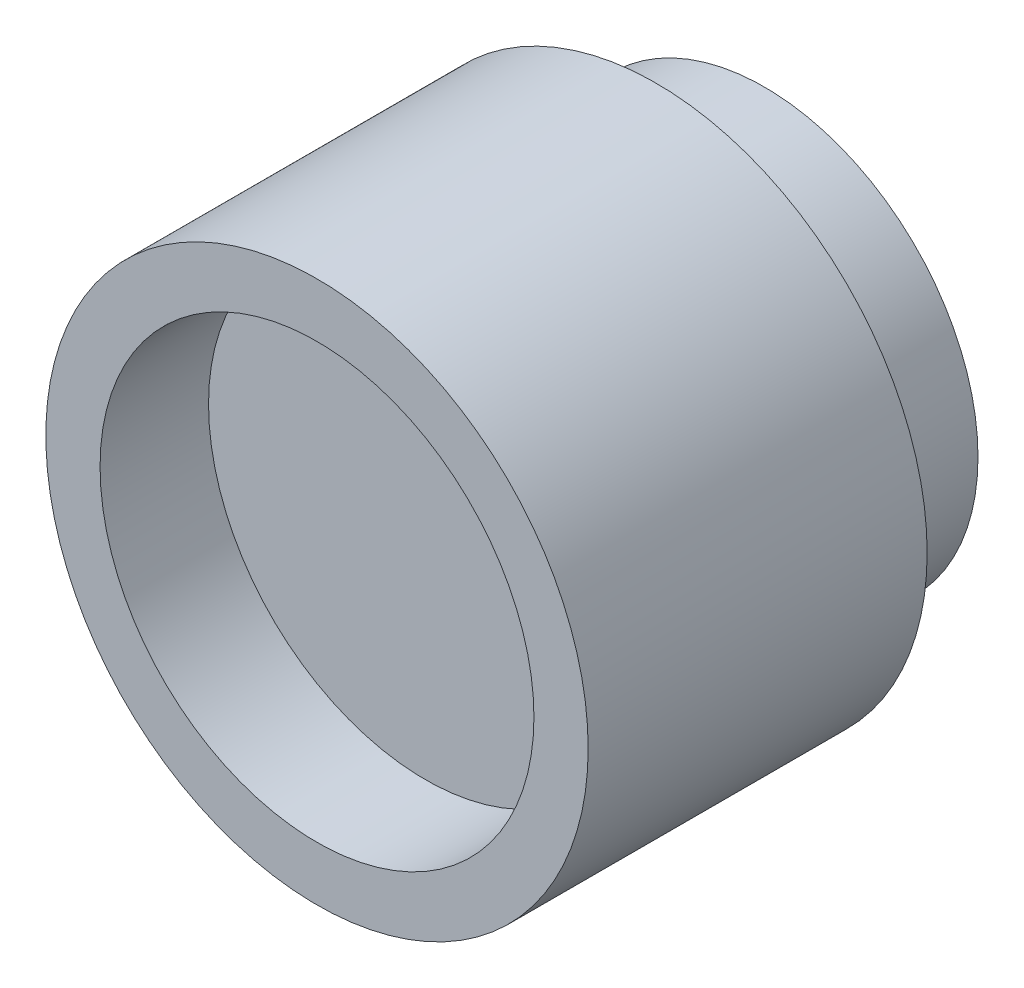
ISO-10303-21;
HEADER;
FILE_DESCRIPTION(('STEP AP214'),'2;1');
FILE_NAME('part.step','',(''),(''),'','','');
FILE_SCHEMA(('AUTOMOTIVE_DESIGN { 1 0 10303 214 1 1 1 1 }'));
ENDSEC;
DATA;
#1=APPLICATION_CONTEXT('core data for automotive mechanical design processes');
#2=APPLICATION_PROTOCOL_DEFINITION('international standard','automotive_design',2000,#1);
#3=PRODUCT_CONTEXT('',#1,'mechanical');
#4=PRODUCT('Part','Part','',(#3));
#5=PRODUCT_RELATED_PRODUCT_CATEGORY('part','',(#4));
#6=PRODUCT_DEFINITION_FORMATION('','',#4);
#7=PRODUCT_DEFINITION_CONTEXT('part definition',#1,'design');
#8=PRODUCT_DEFINITION('design','',#6,#7);
#9=PRODUCT_DEFINITION_SHAPE('','',#8);
#10=(LENGTH_UNIT() NAMED_UNIT(*) SI_UNIT(.MILLI.,.METRE.));
#11=(NAMED_UNIT(*) PLANE_ANGLE_UNIT() SI_UNIT($,.RADIAN.));
#12=(NAMED_UNIT(*) SI_UNIT($,.STERADIAN.) SOLID_ANGLE_UNIT());
#13=UNCERTAINTY_MEASURE_WITH_UNIT(LENGTH_MEASURE(1.E-05),#10,'distance_accuracy_value','');
#14=(GEOMETRIC_REPRESENTATION_CONTEXT(3) GLOBAL_UNCERTAINTY_ASSIGNED_CONTEXT((#13)) GLOBAL_UNIT_ASSIGNED_CONTEXT((#10,
#11,#12)) REPRESENTATION_CONTEXT('',''));
#15=CARTESIAN_POINT('',(0.,0.,0.));
#16=DIRECTION('',(0.,0.,1.));
#17=DIRECTION('',(1.,0.,0.));
#18=AXIS2_PLACEMENT_3D('',#15,#16,#17);
#19=CARTESIAN_POINT('',(0.,0.,33.));
#20=DIRECTION('',(0.,0.,-1.));
#21=DIRECTION('',(-1.,0.,0.));
#22=AXIS2_PLACEMENT_3D('',#19,#20,#21);
#23=CYLINDRICAL_SURFACE('',#22,15.75);
#24=CARTESIAN_POINT('',(0.,0.,0.));
#25=DIRECTION('',(0.,0.,1.));
#26=DIRECTION('',(1.,0.,0.));
#27=AXIS2_PLACEMENT_3D('',#24,#25,#26);
#28=CIRCLE('',#27,15.75);
#29=CARTESIAN_POINT('',(15.75,0.,0.));
#30=VERTEX_POINT('',#29);
#31=EDGE_CURVE('E42',#30,#30,#28,.T.);
#32=ORIENTED_EDGE('',*,*,#31,.T.);
#33=EDGE_LOOP('',(#32));
#34=FACE_BOUND('',#33,.T.);
#35=CARTESIAN_POINT('',(0.,0.,8.));
#36=DIRECTION('',(0.,0.,1.));
#37=DIRECTION('',(1.,0.,0.));
#38=AXIS2_PLACEMENT_3D('',#35,#36,#37);
#39=CIRCLE('',#38,15.75);
#40=CARTESIAN_POINT('',(15.75,0.,8.));
#41=VERTEX_POINT('',#40);
#42=EDGE_CURVE('E11',#41,#41,#39,.T.);
#43=ORIENTED_EDGE('',*,*,#42,.F.);
#44=EDGE_LOOP('',(#43));
#45=FACE_BOUND('',#44,.T.);
#46=ADVANCED_FACE('F36',(#34,#45),#23,.T.);
#47=CARTESIAN_POINT('',(0.,0.,0.));
#48=DIRECTION('',(0.,0.,1.));
#49=DIRECTION('',(1.,0.,0.));
#50=AXIS2_PLACEMENT_3D('',#47,#48,#49);
#51=PLANE('',#50);
#52=ORIENTED_EDGE('',*,*,#31,.F.);
#53=EDGE_LOOP('',(#52));
#54=FACE_BOUND('',#53,.T.);
#55=ADVANCED_FACE('F84',(#54),#51,.F.);
#56=CARTESIAN_POINT('',(0.,0.,8.));
#57=DIRECTION('',(0.,0.,1.));
#58=DIRECTION('',(1.,0.,0.));
#59=AXIS2_PLACEMENT_3D('',#56,#57,#58);
#60=PLANE('',#59);
#61=CARTESIAN_POINT('',(0.,0.,8.00000000000001));
#62=DIRECTION('',(0.,0.,1.));
#63=DIRECTION('',(1.,0.,0.));
#64=AXIS2_PLACEMENT_3D('',#61,#62,#63);
#65=CIRCLE('',#64,20.);
#66=CARTESIAN_POINT('',(20.,0.,8.00000000000001));
#67=VERTEX_POINT('',#66);
#68=EDGE_CURVE('E46',#67,#67,#65,.F.);
#69=ORIENTED_EDGE('',*,*,#68,.T.);
#70=EDGE_LOOP('',(#69));
#71=FACE_BOUND('',#70,.T.);
#72=ORIENTED_EDGE('',*,*,#42,.T.);
#73=EDGE_LOOP('',(#72));
#74=FACE_BOUND('',#73,.T.);
#75=ADVANCED_FACE('F78',(#71,#74),#60,.F.);
#76=CARTESIAN_POINT('',(0.,0.,-56.5685424949238));
#77=DIRECTION('',(0.,0.,1.));
#78=DIRECTION('',(1.,0.,0.));
#79=AXIS2_PLACEMENT_3D('',#76,#77,#78);
#80=CYLINDRICAL_SURFACE('',#79,20.);
#81=ORIENTED_EDGE('',*,*,#68,.F.);
#82=EDGE_LOOP('',(#81));
#83=FACE_BOUND('',#82,.T.);
#84=CARTESIAN_POINT('',(0.,0.,33.));
#85=DIRECTION('',(0.,0.,1.));
#86=DIRECTION('',(1.,0.,0.));
#87=AXIS2_PLACEMENT_3D('',#84,#85,#86);
#88=CIRCLE('',#87,20.);
#89=CARTESIAN_POINT('',(20.,0.,33.));
#90=VERTEX_POINT('',#89);
#91=EDGE_CURVE('E50',#90,#90,#88,.T.);
#92=ORIENTED_EDGE('',*,*,#91,.F.);
#93=EDGE_LOOP('',(#92));
#94=FACE_BOUND('',#93,.T.);
#95=ADVANCED_FACE('F73',(#83,#94),#80,.T.);
#96=CARTESIAN_POINT('',(0.,0.,33.));
#97=DIRECTION('',(0.,0.,1.));
#98=DIRECTION('',(1.,0.,0.));
#99=AXIS2_PLACEMENT_3D('',#96,#97,#98);
#100=PLANE('',#99);
#101=CARTESIAN_POINT('',(0.,0.,33.));
#102=DIRECTION('',(0.,0.,1.));
#103=DIRECTION('',(1.,0.,0.));
#104=AXIS2_PLACEMENT_3D('',#101,#102,#103);
#105=CIRCLE('',#104,16.);
#106=CARTESIAN_POINT('',(16.,0.,33.));
#107=VERTEX_POINT('',#106);
#108=EDGE_CURVE('E56',#107,#107,#105,.T.);
#109=ORIENTED_EDGE('',*,*,#108,.F.);
#110=EDGE_LOOP('',(#109));
#111=FACE_BOUND('',#110,.T.);
#112=ORIENTED_EDGE('',*,*,#91,.T.);
#113=EDGE_LOOP('',(#112));
#114=FACE_BOUND('',#113,.T.);
#115=ADVANCED_FACE('F67',(#111,#114),#100,.T.);
#116=CARTESIAN_POINT('',(0.,0.,25.));
#117=DIRECTION('',(0.,0.,1.));
#118=DIRECTION('',(1.,0.,0.));
#119=AXIS2_PLACEMENT_3D('',#116,#117,#118);
#120=CYLINDRICAL_SURFACE('',#119,16.);
#121=CARTESIAN_POINT('',(0.,0.,25.));
#122=DIRECTION('',(0.,0.,1.));
#123=DIRECTION('',(1.,0.,0.));
#124=AXIS2_PLACEMENT_3D('',#121,#122,#123);
#125=CIRCLE('',#124,16.);
#126=CARTESIAN_POINT('',(16.,0.,25.));
#127=VERTEX_POINT('',#126);
#128=EDGE_CURVE('E55',#127,#127,#125,.T.);
#129=ORIENTED_EDGE('',*,*,#128,.F.);
#130=EDGE_LOOP('',(#129));
#131=FACE_BOUND('',#130,.T.);
#132=ORIENTED_EDGE('',*,*,#108,.T.);
#133=EDGE_LOOP('',(#132));
#134=FACE_BOUND('',#133,.T.);
#135=ADVANCED_FACE('F64',(#131,#134),#120,.F.);
#136=CARTESIAN_POINT('',(0.,0.,25.));
#137=DIRECTION('',(0.,0.,1.));
#138=DIRECTION('',(1.,0.,0.));
#139=AXIS2_PLACEMENT_3D('',#136,#137,#138);
#140=PLANE('',#139);
#141=ORIENTED_EDGE('',*,*,#128,.T.);
#142=EDGE_LOOP('',(#141));
#143=FACE_BOUND('',#142,.T.);
#144=ADVANCED_FACE('F62',(#143),#140,.T.);
#145=CLOSED_SHELL('',(#46,#55,#75,#95,#115,#135,#144));
#146=MANIFOLD_SOLID_BREP('B2',#145);
#147=ADVANCED_BREP_SHAPE_REPRESENTATION('',(#18,#146),#14);
#148=SHAPE_DEFINITION_REPRESENTATION(#9,#147);
ENDSEC;
END-ISO-10303-21;
